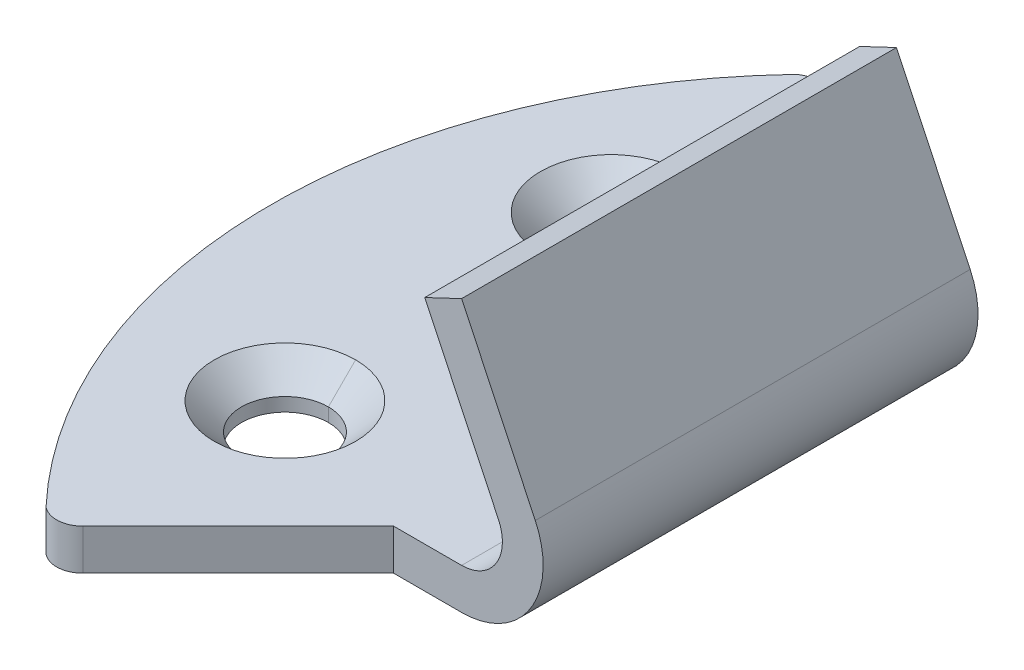
ISO-10303-21;
HEADER;
FILE_DESCRIPTION(('STEP AP214'),'2;1');
FILE_NAME('part.step','',(''),(''),'','','');
FILE_SCHEMA(('AUTOMOTIVE_DESIGN { 1 0 10303 214 1 1 1 1 }'));
ENDSEC;
DATA;
#1=APPLICATION_CONTEXT('core data for automotive mechanical design processes');
#2=APPLICATION_PROTOCOL_DEFINITION('international standard','automotive_design',2000,#1);
#3=PRODUCT_CONTEXT('',#1,'mechanical');
#4=PRODUCT('Part','Part','',(#3));
#5=PRODUCT_RELATED_PRODUCT_CATEGORY('part','',(#4));
#6=PRODUCT_DEFINITION_FORMATION('','',#4);
#7=PRODUCT_DEFINITION_CONTEXT('part definition',#1,'design');
#8=PRODUCT_DEFINITION('design','',#6,#7);
#9=PRODUCT_DEFINITION_SHAPE('','',#8);
#10=(LENGTH_UNIT() NAMED_UNIT(*) SI_UNIT(.MILLI.,.METRE.));
#11=(NAMED_UNIT(*) PLANE_ANGLE_UNIT() SI_UNIT($,.RADIAN.));
#12=(NAMED_UNIT(*) SI_UNIT($,.STERADIAN.) SOLID_ANGLE_UNIT());
#13=UNCERTAINTY_MEASURE_WITH_UNIT(LENGTH_MEASURE(1.E-05),#10,'distance_accuracy_value','');
#14=(GEOMETRIC_REPRESENTATION_CONTEXT(3) GLOBAL_UNCERTAINTY_ASSIGNED_CONTEXT((#13)) GLOBAL_UNIT_ASSIGNED_CONTEXT((#10,
#11,#12)) REPRESENTATION_CONTEXT('',''));
#15=CARTESIAN_POINT('',(0.,0.,0.));
#16=DIRECTION('',(0.,0.,1.));
#17=DIRECTION('',(1.,0.,0.));
#18=AXIS2_PLACEMENT_3D('',#15,#16,#17);
#19=CARTESIAN_POINT('',(6.10059277206298,1.5,-13.0357456534027));
#20=DIRECTION('',(0.,-1.,0.));
#21=DIRECTION('',(-0.0543339958074889,0.,0.998522817415602));
#22=AXIS2_PLACEMENT_3D('',#19,#20,#21);
#23=CYLINDRICAL_SURFACE('',#22,0.964254346597022);
#24=CARTESIAN_POINT('',(6.10059277206298,0.,-13.0357456534027));
#25=DIRECTION('',(0.,1.,0.));
#26=DIRECTION('',(1.,0.,0.));
#27=AXIS2_PLACEMENT_3D('',#24,#25,#26);
#28=CIRCLE('',#27,0.964254346597022);
#29=CARTESIAN_POINT('',(6.7824235593294,0.,-13.717576440671));
#30=VERTEX_POINT('',#29);
#31=CARTESIAN_POINT('',(5.4967714965668,0.,-13.787534395131));
#32=VERTEX_POINT('',#31);
#33=EDGE_CURVE('E11',#30,#32,#28,.T.);
#34=ORIENTED_EDGE('',*,*,#33,.T.);
#35=DIRECTION('',(0.,-1.,0.));
#36=VECTOR('',#35,1.);
#37=CARTESIAN_POINT('',(5.4967714965668,1.5,-13.787534395131));
#38=LINE('',#37,#36);
#39=CARTESIAN_POINT('',(5.4967714965668,1.5,-13.787534395131));
#40=VERTEX_POINT('',#39);
#41=EDGE_CURVE('E25',#40,#32,#38,.T.);
#42=ORIENTED_EDGE('',*,*,#41,.F.);
#43=CARTESIAN_POINT('',(6.10059277206298,1.5,-13.0357456534027));
#44=DIRECTION('',(0.,1.,0.));
#45=DIRECTION('',(1.,0.,0.));
#46=AXIS2_PLACEMENT_3D('',#43,#44,#45);
#47=CIRCLE('',#46,0.964254346597022);
#48=CARTESIAN_POINT('',(6.7824235593294,1.5,-13.717576440671));
#49=VERTEX_POINT('',#48);
#50=EDGE_CURVE('E408',#49,#40,#47,.T.);
#51=ORIENTED_EDGE('',*,*,#50,.F.);
#52=DIRECTION('',(0.,-1.,0.));
#53=VECTOR('',#52,1.);
#54=CARTESIAN_POINT('',(6.7824235593294,1.5,-13.717576440671));
#55=LINE('',#54,#53);
#56=EDGE_CURVE('E404',#49,#30,#55,.T.);
#57=ORIENTED_EDGE('',*,*,#56,.T.);
#58=EDGE_LOOP('',(#34,#42,#51,#57));
#59=FACE_BOUND('',#58,.T.);
#60=ADVANCED_FACE('F17',(#59),#23,.T.);
#61=CARTESIAN_POINT('',(12.5,1.5,-8.));
#62=DIRECTION('',(-0.707106781186572,0.,0.707106781186523));
#63=DIRECTION('',(0.707106781186523,0.,0.707106781186572));
#64=AXIS2_PLACEMENT_3D('',#61,#62,#63);
#65=PLANE('',#64);
#66=DIRECTION('',(-0.707106781186523,0.,-0.707106781186572));
#67=VECTOR('',#66,1.);
#68=CARTESIAN_POINT('',(12.5,0.,-8.));
#69=LINE('',#68,#67);
#70=CARTESIAN_POINT('',(12.5,0.,-8.));
#71=VERTEX_POINT('',#70);
#72=EDGE_CURVE('E398',#71,#30,#69,.T.);
#73=ORIENTED_EDGE('',*,*,#72,.T.);
#74=ORIENTED_EDGE('',*,*,#56,.F.);
#75=DIRECTION('',(-0.707106781186523,0.,-0.707106781186572));
#76=VECTOR('',#75,1.);
#77=CARTESIAN_POINT('',(12.5,1.5,-8.));
#78=LINE('',#77,#76);
#79=CARTESIAN_POINT('',(12.5,1.5,-8.));
#80=VERTEX_POINT('',#79);
#81=EDGE_CURVE('E392',#80,#49,#78,.T.);
#82=ORIENTED_EDGE('',*,*,#81,.F.);
#83=DIRECTION('',(0.,-1.,0.));
#84=VECTOR('',#83,1.);
#85=CARTESIAN_POINT('',(12.5,1.5,-8.));
#86=LINE('',#85,#84);
#87=EDGE_CURVE('E387',#80,#71,#86,.T.);
#88=ORIENTED_EDGE('',*,*,#87,.T.);
#89=EDGE_LOOP('',(#73,#74,#82,#88));
#90=FACE_BOUND('',#89,.T.);
#91=ADVANCED_FACE('F425',(#90),#65,.F.);
#92=CARTESIAN_POINT('',(15.0000000000005,2.99999999999983,-8.));
#93=DIRECTION('',(0.,0.,1.));
#94=DIRECTION('',(1.,0.,0.));
#95=AXIS2_PLACEMENT_3D('',#92,#93,#94);
#96=PLANE('',#95);
#97=DIRECTION('',(1.,0.,0.));
#98=VECTOR('',#97,1.);
#99=CARTESIAN_POINT('',(6.3333333333333,0.,-8.));
#100=LINE('',#99,#98);
#101=CARTESIAN_POINT('',(15.,0.,-8.));
#102=VERTEX_POINT('',#101);
#103=EDGE_CURVE('E381',#71,#102,#100,.T.);
#104=ORIENTED_EDGE('',*,*,#103,.F.);
#105=ORIENTED_EDGE('',*,*,#87,.F.);
#106=DIRECTION('',(-1.,0.,0.));
#107=VECTOR('',#106,1.);
#108=CARTESIAN_POINT('',(15.,1.5,-8.));
#109=LINE('',#108,#107);
#110=CARTESIAN_POINT('',(15.,1.5,-8.));
#111=VERTEX_POINT('',#110);
#112=EDGE_CURVE('E375',#111,#80,#109,.T.);
#113=ORIENTED_EDGE('',*,*,#112,.F.);
#114=CARTESIAN_POINT('',(15.0000000000003,2.99999999999986,-8.));
#115=DIRECTION('',(0.,0.,1.));
#116=DIRECTION('',(1.,0.,0.));
#117=AXIS2_PLACEMENT_3D('',#114,#115,#116);
#118=CIRCLE('',#117,1.49999999999986);
#119=CARTESIAN_POINT('',(16.355261854358,3.6428571428571,-8.));
#120=VERTEX_POINT('',#119);
#121=EDGE_CURVE('E370',#111,#120,#118,.T.);
#122=ORIENTED_EDGE('',*,*,#121,.T.);
#123=DIRECTION('',(0.428571428571455,-0.903507902905239,0.));
#124=VECTOR('',#123,1.);
#125=CARTESIAN_POINT('',(13.644738145642,9.3571428571429,-8.));
#126=LINE('',#125,#124);
#127=CARTESIAN_POINT('',(13.644738145642,9.3571428571429,-8.));
#128=VERTEX_POINT('',#127);
#129=EDGE_CURVE('E365',#128,#120,#126,.T.);
#130=ORIENTED_EDGE('',*,*,#129,.F.);
#131=DIRECTION('',(-0.903507902905277,-0.428571428571374,0.));
#132=VECTOR('',#131,1.);
#133=CARTESIAN_POINT('',(15.,10.,-8.));
#134=LINE('',#133,#132);
#135=CARTESIAN_POINT('',(15.,10.,-8.));
#136=VERTEX_POINT('',#135);
#137=EDGE_CURVE('E360',#136,#128,#134,.T.);
#138=ORIENTED_EDGE('',*,*,#137,.F.);
#139=DIRECTION('',(-0.428571428571461,0.903507902905236,0.));
#140=VECTOR('',#139,1.);
#141=CARTESIAN_POINT('',(17.710523708716,4.2857142857143,-8.));
#142=LINE('',#141,#140);
#143=CARTESIAN_POINT('',(17.710523708716,4.28571428571429,-8.));
#144=VERTEX_POINT('',#143);
#145=EDGE_CURVE('E355',#144,#136,#142,.T.);
#146=ORIENTED_EDGE('',*,*,#145,.F.);
#147=CARTESIAN_POINT('',(15.0000000000005,2.99999999999983,-8.));
#148=DIRECTION('',(0.,0.,1.));
#149=DIRECTION('',(1.,0.,0.));
#150=AXIS2_PLACEMENT_3D('',#147,#148,#149);
#151=CIRCLE('',#150,2.99999999999983);
#152=EDGE_CURVE('E349',#102,#144,#151,.T.);
#153=ORIENTED_EDGE('',*,*,#152,.F.);
#154=EDGE_LOOP('',(#104,#105,#113,#122,#130,#138,#146,#153));
#155=FACE_BOUND('',#154,.T.);
#156=ADVANCED_FACE('F447',(#155),#96,.F.);
#157=CARTESIAN_POINT('',(15.0000000000005,2.99999999999983,8.));
#158=DIRECTION('',(0.,0.,-1.));
#159=DIRECTION('',(-0.845154254728496,0.534522483824882,0.));
#160=AXIS2_PLACEMENT_3D('',#157,#158,#159);
#161=CYLINDRICAL_SURFACE('',#160,2.99999999999983);
#162=ORIENTED_EDGE('',*,*,#152,.T.);
#163=DIRECTION('',(0.,0.,-1.));
#164=VECTOR('',#163,1.);
#165=CARTESIAN_POINT('',(17.710523708716,4.28571428571429,8.));
#166=LINE('',#165,#164);
#167=CARTESIAN_POINT('',(17.710523708716,4.28571428571429,8.));
#168=VERTEX_POINT('',#167);
#169=EDGE_CURVE('E343',#168,#144,#166,.T.);
#170=ORIENTED_EDGE('',*,*,#169,.F.);
#171=CARTESIAN_POINT('',(15.0000000000005,2.99999999999983,8.));
#172=DIRECTION('',(0.,0.,1.));
#173=DIRECTION('',(1.,0.,0.));
#174=AXIS2_PLACEMENT_3D('',#171,#172,#173);
#175=CIRCLE('',#174,2.99999999999983);
#176=CARTESIAN_POINT('',(15.,0.,8.));
#177=VERTEX_POINT('',#176);
#178=EDGE_CURVE('E337',#177,#168,#175,.T.);
#179=ORIENTED_EDGE('',*,*,#178,.F.);
#180=DIRECTION('',(0.,0.,-1.));
#181=VECTOR('',#180,1.);
#182=CARTESIAN_POINT('',(15.,0.,8.));
#183=LINE('',#182,#181);
#184=EDGE_CURVE('E331',#177,#102,#183,.T.);
#185=ORIENTED_EDGE('',*,*,#184,.T.);
#186=EDGE_LOOP('',(#162,#170,#179,#185));
#187=FACE_BOUND('',#186,.T.);
#188=ADVANCED_FACE('F452',(#187),#161,.T.);
#189=CARTESIAN_POINT('',(6.10059277206298,0.,-13.0357456534027));
#190=DIRECTION('',(0.,1.,0.));
#191=DIRECTION('',(0.,0.,1.));
#192=AXIS2_PLACEMENT_3D('',#189,#190,#191);
#193=PLANE('',#192);
#194=CARTESIAN_POINT('',(6.5,0.,-6.));
#195=DIRECTION('',(0.,-1.,0.));
#196=DIRECTION('',(0.,0.,-1.));
#197=AXIS2_PLACEMENT_3D('',#194,#195,#196);
#198=CIRCLE('',#197,1.6);
#199=CARTESIAN_POINT('',(6.5,0.,-4.4));
#200=VERTEX_POINT('',#199);
#201=CARTESIAN_POINT('',(6.5,0.,-7.6));
#202=VERTEX_POINT('',#201);
#203=EDGE_CURVE('E162',#200,#202,#198,.T.);
#204=ORIENTED_EDGE('',*,*,#203,.F.);
#205=CARTESIAN_POINT('',(6.5,0.,-6.));
#206=DIRECTION('',(0.,-1.,0.));
#207=DIRECTION('',(0.,0.,-1.));
#208=AXIS2_PLACEMENT_3D('',#205,#206,#207);
#209=CIRCLE('',#208,1.6);
#210=EDGE_CURVE('E324',#202,#200,#209,.T.);
#211=ORIENTED_EDGE('',*,*,#210,.F.);
#212=EDGE_LOOP('',(#204,#211));
#213=FACE_BOUND('',#212,.T.);
#214=CARTESIAN_POINT('',(6.5,0.,6.));
#215=DIRECTION('',(0.,-1.,0.));
#216=DIRECTION('',(0.,0.,-1.));
#217=AXIS2_PLACEMENT_3D('',#214,#215,#216);
#218=CIRCLE('',#217,1.6);
#219=CARTESIAN_POINT('',(6.5,0.,7.6));
#220=VERTEX_POINT('',#219);
#221=CARTESIAN_POINT('',(6.5,0.,4.4));
#222=VERTEX_POINT('',#221);
#223=EDGE_CURVE('E319',#220,#222,#218,.T.);
#224=ORIENTED_EDGE('',*,*,#223,.F.);
#225=CARTESIAN_POINT('',(6.5,0.,6.));
#226=DIRECTION('',(0.,-1.,0.));
#227=DIRECTION('',(0.,0.,-1.));
#228=AXIS2_PLACEMENT_3D('',#225,#226,#227);
#229=CIRCLE('',#228,1.6);
#230=EDGE_CURVE('E314',#222,#220,#229,.T.);
#231=ORIENTED_EDGE('',*,*,#230,.F.);
#232=EDGE_LOOP('',(#224,#231));
#233=FACE_BOUND('',#232,.T.);
#234=ORIENTED_EDGE('',*,*,#72,.F.);
#235=ORIENTED_EDGE('',*,*,#103,.T.);
#236=ORIENTED_EDGE('',*,*,#184,.F.);
#237=DIRECTION('',(1.,0.,0.));
#238=VECTOR('',#237,1.);
#239=CARTESIAN_POINT('',(6.3333333333333,0.,8.));
#240=LINE('',#239,#238);
#241=CARTESIAN_POINT('',(12.5,0.,8.));
#242=VERTEX_POINT('',#241);
#243=EDGE_CURVE('E309',#242,#177,#240,.T.);
#244=ORIENTED_EDGE('',*,*,#243,.F.);
#245=DIRECTION('',(0.707106781186523,0.,-0.707106781186572));
#246=VECTOR('',#245,1.);
#247=CARTESIAN_POINT('',(6.7824235593294,0.,13.717576440671));
#248=LINE('',#247,#246);
#249=CARTESIAN_POINT('',(6.7824235593294,0.,13.717576440671));
#250=VERTEX_POINT('',#249);
#251=EDGE_CURVE('E304',#250,#242,#248,.T.);
#252=ORIENTED_EDGE('',*,*,#251,.F.);
#253=CARTESIAN_POINT('',(6.10059277206277,0.,13.0357456534022));
#254=DIRECTION('',(0.,1.,0.));
#255=DIRECTION('',(1.,0.,0.));
#256=AXIS2_PLACEMENT_3D('',#253,#254,#255);
#257=CIRCLE('',#256,0.964254346597546);
#258=CARTESIAN_POINT('',(5.49677149656639,0.,13.787534395131));
#259=VERTEX_POINT('',#258);
#260=EDGE_CURVE('E299',#259,#250,#257,.T.);
#261=ORIENTED_EDGE('',*,*,#260,.F.);
#262=CARTESIAN_POINT('',(20.04,0.,2.10768902331182E-13));
#263=DIRECTION('',(0.,1.,0.));
#264=DIRECTION('',(1.,0.,0.));
#265=AXIS2_PLACEMENT_3D('',#262,#263,#264);
#266=CIRCLE('',#265,20.04);
#267=EDGE_CURVE('E294',#32,#259,#266,.T.);
#268=ORIENTED_EDGE('',*,*,#267,.F.);
#269=ORIENTED_EDGE('',*,*,#33,.F.);
#270=EDGE_LOOP('',(#234,#235,#236,#244,#252,#261,#268,#269));
#271=FACE_BOUND('',#270,.T.);
#272=ADVANCED_FACE('F429',(#213,#233,#271),#193,.F.);
#273=CARTESIAN_POINT('',(20.04,1.5,2.10768902331182E-13));
#274=DIRECTION('',(0.,-1.,0.));
#275=DIRECTION('',(1.,0.,0.));
#276=AXIS2_PLACEMENT_3D('',#273,#274,#275);
#277=CYLINDRICAL_SURFACE('',#276,20.04);
#278=ORIENTED_EDGE('',*,*,#267,.T.);
#279=DIRECTION('',(0.,-1.,0.));
#280=VECTOR('',#279,1.);
#281=CARTESIAN_POINT('',(5.49677149656639,1.5,13.787534395131));
#282=LINE('',#281,#280);
#283=CARTESIAN_POINT('',(5.49677149656639,1.5,13.787534395131));
#284=VERTEX_POINT('',#283);
#285=EDGE_CURVE('E289',#284,#259,#282,.T.);
#286=ORIENTED_EDGE('',*,*,#285,.F.);
#287=CARTESIAN_POINT('',(20.04,1.5,2.10768902331182E-13));
#288=DIRECTION('',(0.,1.,0.));
#289=DIRECTION('',(1.,0.,0.));
#290=AXIS2_PLACEMENT_3D('',#287,#288,#289);
#291=CIRCLE('',#290,20.04);
#292=EDGE_CURVE('E284',#40,#284,#291,.T.);
#293=ORIENTED_EDGE('',*,*,#292,.F.);
#294=ORIENTED_EDGE('',*,*,#41,.T.);
#295=EDGE_LOOP('',(#278,#286,#293,#294));
#296=FACE_BOUND('',#295,.T.);
#297=ADVANCED_FACE('F418',(#296),#277,.T.);
#298=CARTESIAN_POINT('',(6.10059277206298,1.5,-13.0357456534027));
#299=DIRECTION('',(0.,1.,0.));
#300=DIRECTION('',(0.,0.,1.));
#301=AXIS2_PLACEMENT_3D('',#298,#299,#300);
#302=PLANE('',#301);
#303=CARTESIAN_POINT('',(6.5,1.5,-6.));
#304=DIRECTION('',(0.,-1.,0.));
#305=DIRECTION('',(0.,0.,-1.));
#306=AXIS2_PLACEMENT_3D('',#303,#304,#305);
#307=CIRCLE('',#306,2.6);
#308=CARTESIAN_POINT('',(6.5,1.5,-8.6));
#309=VERTEX_POINT('',#308);
#310=CARTESIAN_POINT('',(6.5,1.5,-3.4));
#311=VERTEX_POINT('',#310);
#312=EDGE_CURVE('E172',#309,#311,#307,.T.);
#313=ORIENTED_EDGE('',*,*,#312,.T.);
#314=CARTESIAN_POINT('',(6.5,1.5,-6.));
#315=DIRECTION('',(0.,-1.,0.));
#316=DIRECTION('',(0.,0.,-1.));
#317=AXIS2_PLACEMENT_3D('',#314,#315,#316);
#318=CIRCLE('',#317,2.6);
#319=EDGE_CURVE('E277',#311,#309,#318,.T.);
#320=ORIENTED_EDGE('',*,*,#319,.T.);
#321=EDGE_LOOP('',(#313,#320));
#322=FACE_BOUND('',#321,.T.);
#323=CARTESIAN_POINT('',(6.5,1.5,6.));
#324=DIRECTION('',(0.,-1.,0.));
#325=DIRECTION('',(0.,0.,-1.));
#326=AXIS2_PLACEMENT_3D('',#323,#324,#325);
#327=CIRCLE('',#326,2.6);
#328=CARTESIAN_POINT('',(6.5,1.5,3.4));
#329=VERTEX_POINT('',#328);
#330=CARTESIAN_POINT('',(6.5,1.5,8.6));
#331=VERTEX_POINT('',#330);
#332=EDGE_CURVE('E273',#329,#331,#327,.T.);
#333=ORIENTED_EDGE('',*,*,#332,.T.);
#334=CARTESIAN_POINT('',(6.5,1.5,6.));
#335=DIRECTION('',(0.,-1.,0.));
#336=DIRECTION('',(0.,0.,-1.));
#337=AXIS2_PLACEMENT_3D('',#334,#335,#336);
#338=CIRCLE('',#337,2.6);
#339=EDGE_CURVE('E269',#331,#329,#338,.T.);
#340=ORIENTED_EDGE('',*,*,#339,.T.);
#341=EDGE_LOOP('',(#333,#340));
#342=FACE_BOUND('',#341,.T.);
#343=DIRECTION('',(0.707106781186523,0.,-0.707106781186572));
#344=VECTOR('',#343,1.);
#345=CARTESIAN_POINT('',(6.7824235593294,1.5,13.717576440671));
#346=LINE('',#345,#344);
#347=CARTESIAN_POINT('',(6.7824235593294,1.5,13.717576440671));
#348=VERTEX_POINT('',#347);
#349=CARTESIAN_POINT('',(12.5,1.5,8.));
#350=VERTEX_POINT('',#349);
#351=EDGE_CURVE('E265',#348,#350,#346,.T.);
#352=ORIENTED_EDGE('',*,*,#351,.T.);
#353=DIRECTION('',(-1.,0.,0.));
#354=VECTOR('',#353,1.);
#355=CARTESIAN_POINT('',(15.,1.5,8.));
#356=LINE('',#355,#354);
#357=CARTESIAN_POINT('',(15.,1.5,8.));
#358=VERTEX_POINT('',#357);
#359=EDGE_CURVE('E260',#358,#350,#356,.T.);
#360=ORIENTED_EDGE('',*,*,#359,.F.);
#361=DIRECTION('',(0.,0.,-1.));
#362=VECTOR('',#361,1.);
#363=CARTESIAN_POINT('',(15.,1.5,8.));
#364=LINE('',#363,#362);
#365=EDGE_CURVE('E254',#358,#111,#364,.T.);
#366=ORIENTED_EDGE('',*,*,#365,.T.);
#367=ORIENTED_EDGE('',*,*,#112,.T.);
#368=ORIENTED_EDGE('',*,*,#81,.T.);
#369=ORIENTED_EDGE('',*,*,#50,.T.);
#370=ORIENTED_EDGE('',*,*,#292,.T.);
#371=CARTESIAN_POINT('',(6.10059277206277,1.5,13.0357456534022));
#372=DIRECTION('',(0.,1.,0.));
#373=DIRECTION('',(1.,0.,0.));
#374=AXIS2_PLACEMENT_3D('',#371,#372,#373);
#375=CIRCLE('',#374,0.964254346597546);
#376=EDGE_CURVE('E250',#284,#348,#375,.T.);
#377=ORIENTED_EDGE('',*,*,#376,.T.);
#378=EDGE_LOOP('',(#352,#360,#366,#367,#368,#369,#370,#377));
#379=FACE_BOUND('',#378,.T.);
#380=ADVANCED_FACE('F421',(#322,#342,#379),#302,.T.);
#381=CARTESIAN_POINT('',(6.10059277206277,1.5,13.0357456534022));
#382=DIRECTION('',(0.,-1.,0.));
#383=DIRECTION('',(-0.0543339958074629,0.,-0.998522817415604));
#384=AXIS2_PLACEMENT_3D('',#381,#382,#383);
#385=CYLINDRICAL_SURFACE('',#384,0.964254346597546);
#386=ORIENTED_EDGE('',*,*,#260,.T.);
#387=DIRECTION('',(0.,-1.,0.));
#388=VECTOR('',#387,1.);
#389=CARTESIAN_POINT('',(6.7824235593294,1.5,13.717576440671));
#390=LINE('',#389,#388);
#391=EDGE_CURVE('E245',#348,#250,#390,.T.);
#392=ORIENTED_EDGE('',*,*,#391,.F.);
#393=ORIENTED_EDGE('',*,*,#376,.F.);
#394=ORIENTED_EDGE('',*,*,#285,.T.);
#395=EDGE_LOOP('',(#386,#392,#393,#394));
#396=FACE_BOUND('',#395,.T.);
#397=ADVANCED_FACE('F432',(#396),#385,.T.);
#398=CARTESIAN_POINT('',(6.7824235593294,1.5,13.717576440671));
#399=DIRECTION('',(-0.707106781186572,0.,-0.707106781186523));
#400=DIRECTION('',(-0.707106781186523,0.,0.707106781186572));
#401=AXIS2_PLACEMENT_3D('',#398,#399,#400);
#402=PLANE('',#401);
#403=ORIENTED_EDGE('',*,*,#251,.T.);
#404=DIRECTION('',(0.,-1.,0.));
#405=VECTOR('',#404,1.);
#406=CARTESIAN_POINT('',(12.5,1.5,8.));
#407=LINE('',#406,#405);
#408=EDGE_CURVE('E240',#350,#242,#407,.T.);
#409=ORIENTED_EDGE('',*,*,#408,.F.);
#410=ORIENTED_EDGE('',*,*,#351,.F.);
#411=ORIENTED_EDGE('',*,*,#391,.T.);
#412=EDGE_LOOP('',(#403,#409,#410,#411));
#413=FACE_BOUND('',#412,.T.);
#414=ADVANCED_FACE('F437',(#413),#402,.F.);
#415=CARTESIAN_POINT('',(15.0000000000005,2.99999999999983,8.));
#416=DIRECTION('',(0.,0.,1.));
#417=DIRECTION('',(1.,0.,0.));
#418=AXIS2_PLACEMENT_3D('',#415,#416,#417);
#419=PLANE('',#418);
#420=ORIENTED_EDGE('',*,*,#408,.T.);
#421=ORIENTED_EDGE('',*,*,#243,.T.);
#422=ORIENTED_EDGE('',*,*,#178,.T.);
#423=DIRECTION('',(-0.428571428571461,0.903507902905236,0.));
#424=VECTOR('',#423,1.);
#425=CARTESIAN_POINT('',(17.710523708716,4.2857142857143,8.));
#426=LINE('',#425,#424);
#427=CARTESIAN_POINT('',(15.,10.,8.));
#428=VERTEX_POINT('',#427);
#429=EDGE_CURVE('E235',#168,#428,#426,.T.);
#430=ORIENTED_EDGE('',*,*,#429,.T.);
#431=DIRECTION('',(-0.903507902905277,-0.428571428571374,0.));
#432=VECTOR('',#431,1.);
#433=CARTESIAN_POINT('',(15.,10.,8.));
#434=LINE('',#433,#432);
#435=CARTESIAN_POINT('',(13.644738145642,9.3571428571429,8.));
#436=VERTEX_POINT('',#435);
#437=EDGE_CURVE('E231',#428,#436,#434,.T.);
#438=ORIENTED_EDGE('',*,*,#437,.T.);
#439=DIRECTION('',(0.428571428571455,-0.903507902905239,0.));
#440=VECTOR('',#439,1.);
#441=CARTESIAN_POINT('',(13.644738145642,9.3571428571429,8.));
#442=LINE('',#441,#440);
#443=CARTESIAN_POINT('',(16.355261854358,3.6428571428571,8.));
#444=VERTEX_POINT('',#443);
#445=EDGE_CURVE('E227',#436,#444,#442,.T.);
#446=ORIENTED_EDGE('',*,*,#445,.T.);
#447=CARTESIAN_POINT('',(15.0000000000003,2.99999999999986,8.));
#448=DIRECTION('',(0.,0.,1.));
#449=DIRECTION('',(1.,0.,0.));
#450=AXIS2_PLACEMENT_3D('',#447,#448,#449);
#451=CIRCLE('',#450,1.49999999999986);
#452=EDGE_CURVE('E222',#358,#444,#451,.T.);
#453=ORIENTED_EDGE('',*,*,#452,.F.);
#454=ORIENTED_EDGE('',*,*,#359,.T.);
#455=EDGE_LOOP('',(#420,#421,#422,#430,#438,#446,#453,#454));
#456=FACE_BOUND('',#455,.T.);
#457=ADVANCED_FACE('F439',(#456),#419,.T.);
#458=CARTESIAN_POINT('',(15.0000000000003,2.99999999999986,8.));
#459=DIRECTION('',(0.,0.,-1.));
#460=DIRECTION('',(-0.845154254728491,0.534522483824889,0.));
#461=AXIS2_PLACEMENT_3D('',#458,#459,#460);
#462=CYLINDRICAL_SURFACE('',#461,1.49999999999986);
#463=ORIENTED_EDGE('',*,*,#121,.F.);
#464=ORIENTED_EDGE('',*,*,#365,.F.);
#465=ORIENTED_EDGE('',*,*,#452,.T.);
#466=DIRECTION('',(0.,0.,-1.));
#467=VECTOR('',#466,1.);
#468=CARTESIAN_POINT('',(16.355261854358,3.6428571428571,8.));
#469=LINE('',#468,#467);
#470=EDGE_CURVE('E217',#444,#120,#469,.T.);
#471=ORIENTED_EDGE('',*,*,#470,.T.);
#472=EDGE_LOOP('',(#463,#464,#465,#471));
#473=FACE_BOUND('',#472,.T.);
#474=ADVANCED_FACE('F445',(#473),#462,.F.);
#475=CARTESIAN_POINT('',(13.644738145642,9.3571428571429,8.));
#476=DIRECTION('',(0.903507902905239,0.428571428571455,0.));
#477=DIRECTION('',(-0.428571428571455,0.903507902905239,0.));
#478=AXIS2_PLACEMENT_3D('',#475,#476,#477);
#479=PLANE('',#478);
#480=ORIENTED_EDGE('',*,*,#129,.T.);
#481=ORIENTED_EDGE('',*,*,#470,.F.);
#482=ORIENTED_EDGE('',*,*,#445,.F.);
#483=DIRECTION('',(0.,0.,-1.));
#484=VECTOR('',#483,1.);
#485=CARTESIAN_POINT('',(13.644738145642,9.3571428571429,8.));
#486=LINE('',#485,#484);
#487=EDGE_CURVE('E212',#436,#128,#486,.T.);
#488=ORIENTED_EDGE('',*,*,#487,.T.);
#489=EDGE_LOOP('',(#480,#481,#482,#488));
#490=FACE_BOUND('',#489,.T.);
#491=ADVANCED_FACE('F460',(#490),#479,.F.);
#492=CARTESIAN_POINT('',(15.,10.,8.));
#493=DIRECTION('',(0.428571428571374,-0.903507902905277,0.));
#494=DIRECTION('',(0.903507902905277,0.428571428571374,0.));
#495=AXIS2_PLACEMENT_3D('',#492,#493,#494);
#496=PLANE('',#495);
#497=ORIENTED_EDGE('',*,*,#137,.T.);
#498=ORIENTED_EDGE('',*,*,#487,.F.);
#499=ORIENTED_EDGE('',*,*,#437,.F.);
#500=DIRECTION('',(0.,0.,-1.));
#501=VECTOR('',#500,1.);
#502=CARTESIAN_POINT('',(15.,10.,8.));
#503=LINE('',#502,#501);
#504=EDGE_CURVE('E207',#428,#136,#503,.T.);
#505=ORIENTED_EDGE('',*,*,#504,.T.);
#506=EDGE_LOOP('',(#497,#498,#499,#505));
#507=FACE_BOUND('',#506,.T.);
#508=ADVANCED_FACE('F458',(#507),#496,.F.);
#509=CARTESIAN_POINT('',(17.710523708716,4.2857142857143,8.));
#510=DIRECTION('',(-0.903507902905236,-0.428571428571461,0.));
#511=DIRECTION('',(0.428571428571461,-0.903507902905236,0.));
#512=AXIS2_PLACEMENT_3D('',#509,#510,#511);
#513=PLANE('',#512);
#514=ORIENTED_EDGE('',*,*,#145,.T.);
#515=ORIENTED_EDGE('',*,*,#504,.F.);
#516=ORIENTED_EDGE('',*,*,#429,.F.);
#517=ORIENTED_EDGE('',*,*,#169,.T.);
#518=EDGE_LOOP('',(#514,#515,#516,#517));
#519=FACE_BOUND('',#518,.T.);
#520=ADVANCED_FACE('F454',(#519),#513,.F.);
#521=CARTESIAN_POINT('',(6.5,1.5,6.));
#522=DIRECTION('',(0.,1.,0.));
#523=DIRECTION('',(1.,0.,0.));
#524=AXIS2_PLACEMENT_3D('',#521,#522,#523);
#525=CONICAL_SURFACE('',#524,2.6,0.785398163397449);
#526=DIRECTION('',(0.,0.707106781186547,-0.707106781186548));
#527=VECTOR('',#526,1.);
#528=CARTESIAN_POINT('',(6.5,0.5,4.4));
#529=LINE('',#528,#527);
#530=CARTESIAN_POINT('',(6.5,0.5,4.4));
#531=VERTEX_POINT('',#530);
#532=EDGE_CURVE('E202',#531,#329,#529,.T.);
#533=ORIENTED_EDGE('',*,*,#532,.T.);
#534=ORIENTED_EDGE('',*,*,#339,.F.);
#535=DIRECTION('',(0.,0.707106781186547,0.707106781186548));
#536=VECTOR('',#535,1.);
#537=CARTESIAN_POINT('',(6.5,0.5,7.6));
#538=LINE('',#537,#536);
#539=CARTESIAN_POINT('',(6.5,0.5,7.6));
#540=VERTEX_POINT('',#539);
#541=EDGE_CURVE('E197',#540,#331,#538,.T.);
#542=ORIENTED_EDGE('',*,*,#541,.F.);
#543=CARTESIAN_POINT('',(6.5,0.5,6.));
#544=DIRECTION('',(0.,-1.,0.));
#545=DIRECTION('',(0.,0.,-1.));
#546=AXIS2_PLACEMENT_3D('',#543,#544,#545);
#547=CIRCLE('',#546,1.6);
#548=EDGE_CURVE('E193',#540,#531,#547,.T.);
#549=ORIENTED_EDGE('',*,*,#548,.T.);
#550=EDGE_LOOP('',(#533,#534,#542,#549));
#551=FACE_BOUND('',#550,.T.);
#552=ADVANCED_FACE('F529',(#551),#525,.F.);
#553=CARTESIAN_POINT('',(6.5,0.,6.));
#554=DIRECTION('',(0.,-1.,0.));
#555=DIRECTION('',(1.,0.,0.));
#556=AXIS2_PLACEMENT_3D('',#553,#554,#555);
#557=CYLINDRICAL_SURFACE('',#556,1.6);
#558=DIRECTION('',(0.,-1.,0.));
#559=VECTOR('',#558,1.);
#560=CARTESIAN_POINT('',(6.5,0.5,7.6));
#561=LINE('',#560,#559);
#562=EDGE_CURVE('E188',#540,#220,#561,.T.);
#563=ORIENTED_EDGE('',*,*,#562,.T.);
#564=ORIENTED_EDGE('',*,*,#223,.T.);
#565=DIRECTION('',(0.,-1.,0.));
#566=VECTOR('',#565,1.);
#567=CARTESIAN_POINT('',(6.5,0.5,4.4));
#568=LINE('',#567,#566);
#569=EDGE_CURVE('E176',#531,#222,#568,.T.);
#570=ORIENTED_EDGE('',*,*,#569,.F.);
#571=ORIENTED_EDGE('',*,*,#548,.F.);
#572=EDGE_LOOP('',(#563,#564,#570,#571));
#573=FACE_BOUND('',#572,.T.);
#574=ADVANCED_FACE('F539',(#573),#557,.F.);
#575=CARTESIAN_POINT('',(6.5,0.,6.));
#576=DIRECTION('',(0.,-1.,0.));
#577=DIRECTION('',(-1.,0.,0.));
#578=AXIS2_PLACEMENT_3D('',#575,#576,#577);
#579=CYLINDRICAL_SURFACE('',#578,1.6);
#580=ORIENTED_EDGE('',*,*,#562,.F.);
#581=CARTESIAN_POINT('',(6.5,0.5,6.));
#582=DIRECTION('',(0.,-1.,0.));
#583=DIRECTION('',(0.,0.,-1.));
#584=AXIS2_PLACEMENT_3D('',#581,#582,#583);
#585=CIRCLE('',#584,1.6);
#586=EDGE_CURVE('E173',#531,#540,#585,.T.);
#587=ORIENTED_EDGE('',*,*,#586,.F.);
#588=ORIENTED_EDGE('',*,*,#569,.T.);
#589=ORIENTED_EDGE('',*,*,#230,.T.);
#590=EDGE_LOOP('',(#580,#587,#588,#589));
#591=FACE_BOUND('',#590,.T.);
#592=ADVANCED_FACE('F550',(#591),#579,.F.);
#593=CARTESIAN_POINT('',(6.5,1.5,6.));
#594=DIRECTION('',(0.,1.,0.));
#595=DIRECTION('',(-1.,0.,0.));
#596=AXIS2_PLACEMENT_3D('',#593,#594,#595);
#597=CONICAL_SURFACE('',#596,2.6,0.785398163397449);
#598=ORIENTED_EDGE('',*,*,#532,.F.);
#599=ORIENTED_EDGE('',*,*,#586,.T.);
#600=ORIENTED_EDGE('',*,*,#541,.T.);
#601=ORIENTED_EDGE('',*,*,#332,.F.);
#602=EDGE_LOOP('',(#598,#599,#600,#601));
#603=FACE_BOUND('',#602,.T.);
#604=ADVANCED_FACE('F561',(#603),#597,.F.);
#605=CARTESIAN_POINT('',(6.5,1.5,-6.));
#606=DIRECTION('',(0.,1.,0.));
#607=DIRECTION('',(1.,0.,0.));
#608=AXIS2_PLACEMENT_3D('',#605,#606,#607);
#609=CONICAL_SURFACE('',#608,2.6,0.785398163397449);
#610=DIRECTION('',(0.,0.707106781186547,-0.707106781186548));
#611=VECTOR('',#610,1.);
#612=CARTESIAN_POINT('',(6.5,0.5,-7.6));
#613=LINE('',#612,#611);
#614=CARTESIAN_POINT('',(6.5,0.5,-7.6));
#615=VERTEX_POINT('',#614);
#616=EDGE_CURVE('E148',#615,#309,#613,.T.);
#617=ORIENTED_EDGE('',*,*,#616,.T.);
#618=ORIENTED_EDGE('',*,*,#319,.F.);
#619=DIRECTION('',(0.,0.707106781186547,0.707106781186548));
#620=VECTOR('',#619,1.);
#621=CARTESIAN_POINT('',(6.5,0.5,-4.4));
#622=LINE('',#621,#620);
#623=CARTESIAN_POINT('',(6.5,0.5,-4.4));
#624=VERTEX_POINT('',#623);
#625=EDGE_CURVE('E151',#624,#311,#622,.T.);
#626=ORIENTED_EDGE('',*,*,#625,.F.);
#627=CARTESIAN_POINT('',(6.5,0.5,-6.));
#628=DIRECTION('',(0.,-1.,0.));
#629=DIRECTION('',(0.,0.,-1.));
#630=AXIS2_PLACEMENT_3D('',#627,#628,#629);
#631=CIRCLE('',#630,1.6);
#632=EDGE_CURVE('E143',#624,#615,#631,.T.);
#633=ORIENTED_EDGE('',*,*,#632,.T.);
#634=EDGE_LOOP('',(#617,#618,#626,#633));
#635=FACE_BOUND('',#634,.T.);
#636=ADVANCED_FACE('F145',(#635),#609,.F.);
#637=CARTESIAN_POINT('',(6.5,0.,-6.));
#638=DIRECTION('',(0.,-1.,0.));
#639=DIRECTION('',(1.,0.,0.));
#640=AXIS2_PLACEMENT_3D('',#637,#638,#639);
#641=CYLINDRICAL_SURFACE('',#640,1.6);
#642=DIRECTION('',(0.,-1.,0.));
#643=VECTOR('',#642,1.);
#644=CARTESIAN_POINT('',(6.5,0.5,-4.4));
#645=LINE('',#644,#643);
#646=EDGE_CURVE('E155',#624,#200,#645,.T.);
#647=ORIENTED_EDGE('',*,*,#646,.T.);
#648=ORIENTED_EDGE('',*,*,#203,.T.);
#649=DIRECTION('',(0.,-1.,0.));
#650=VECTOR('',#649,1.);
#651=CARTESIAN_POINT('',(6.5,0.5,-7.6));
#652=LINE('',#651,#650);
#653=EDGE_CURVE('E159',#615,#202,#652,.T.);
#654=ORIENTED_EDGE('',*,*,#653,.F.);
#655=ORIENTED_EDGE('',*,*,#632,.F.);
#656=EDGE_LOOP('',(#647,#648,#654,#655));
#657=FACE_BOUND('',#656,.T.);
#658=ADVANCED_FACE('F161',(#657),#641,.F.);
#659=CARTESIAN_POINT('',(6.5,0.,-6.));
#660=DIRECTION('',(0.,-1.,0.));
#661=DIRECTION('',(-1.,0.,0.));
#662=AXIS2_PLACEMENT_3D('',#659,#660,#661);
#663=CYLINDRICAL_SURFACE('',#662,1.6);
#664=ORIENTED_EDGE('',*,*,#646,.F.);
#665=CARTESIAN_POINT('',(6.5,0.5,-6.));
#666=DIRECTION('',(0.,-1.,0.));
#667=DIRECTION('',(0.,0.,-1.));
#668=AXIS2_PLACEMENT_3D('',#665,#666,#667);
#669=CIRCLE('',#668,1.6);
#670=EDGE_CURVE('E165',#615,#624,#669,.T.);
#671=ORIENTED_EDGE('',*,*,#670,.F.);
#672=ORIENTED_EDGE('',*,*,#653,.T.);
#673=ORIENTED_EDGE('',*,*,#210,.T.);
#674=EDGE_LOOP('',(#664,#671,#672,#673));
#675=FACE_BOUND('',#674,.T.);
#676=ADVANCED_FACE('F168',(#675),#663,.F.);
#677=CARTESIAN_POINT('',(6.5,1.5,-6.));
#678=DIRECTION('',(0.,1.,0.));
#679=DIRECTION('',(-1.,0.,0.));
#680=AXIS2_PLACEMENT_3D('',#677,#678,#679);
#681=CONICAL_SURFACE('',#680,2.6,0.785398163397449);
#682=ORIENTED_EDGE('',*,*,#616,.F.);
#683=ORIENTED_EDGE('',*,*,#670,.T.);
#684=ORIENTED_EDGE('',*,*,#625,.T.);
#685=ORIENTED_EDGE('',*,*,#312,.F.);
#686=EDGE_LOOP('',(#682,#683,#684,#685));
#687=FACE_BOUND('',#686,.T.);
#688=ADVANCED_FACE('F171',(#687),#681,.F.);
#689=CLOSED_SHELL('',(#60,#91,#156,#188,#272,#297,#380,#397,#414,#457,#474,#491,#508,#520,#552,
#574,#592,#604,#636,#658,#676,#688));
#690=MANIFOLD_SOLID_BREP('B1',#689);
#691=ADVANCED_BREP_SHAPE_REPRESENTATION('',(#18,#690),#14);
#692=SHAPE_DEFINITION_REPRESENTATION(#9,#691);
ENDSEC;
END-ISO-10303-21;
